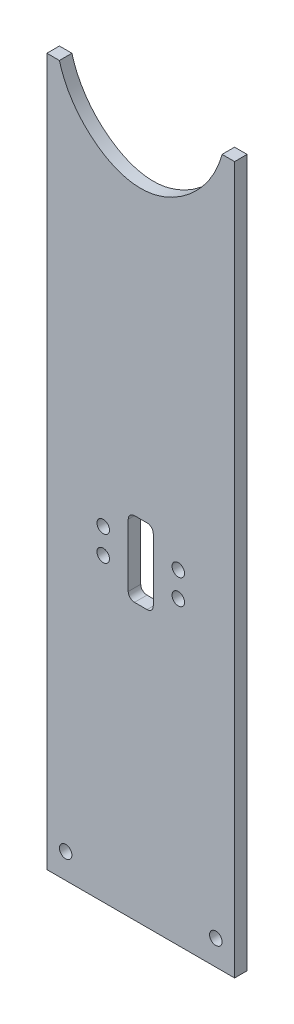
ISO-10303-21;
HEADER;
FILE_DESCRIPTION(('STEP AP214'),'2;1');
FILE_NAME('part.step','',(''),(''),'','','');
FILE_SCHEMA(('AUTOMOTIVE_DESIGN { 1 0 10303 214 1 1 1 1 }'));
ENDSEC;
DATA;
#1=APPLICATION_CONTEXT('core data for automotive mechanical design processes');
#2=APPLICATION_PROTOCOL_DEFINITION('international standard','automotive_design',2000,#1);
#3=PRODUCT_CONTEXT('',#1,'mechanical');
#4=PRODUCT('Part','Part','',(#3));
#5=PRODUCT_RELATED_PRODUCT_CATEGORY('part','',(#4));
#6=PRODUCT_DEFINITION_FORMATION('','',#4);
#7=PRODUCT_DEFINITION_CONTEXT('part definition',#1,'design');
#8=PRODUCT_DEFINITION('design','',#6,#7);
#9=PRODUCT_DEFINITION_SHAPE('','',#8);
#10=(LENGTH_UNIT() NAMED_UNIT(*) SI_UNIT(.MILLI.,.METRE.));
#11=(NAMED_UNIT(*) PLANE_ANGLE_UNIT() SI_UNIT($,.RADIAN.));
#12=(NAMED_UNIT(*) SI_UNIT($,.STERADIAN.) SOLID_ANGLE_UNIT());
#13=UNCERTAINTY_MEASURE_WITH_UNIT(LENGTH_MEASURE(1.E-05),#10,'distance_accuracy_value','');
#14=(GEOMETRIC_REPRESENTATION_CONTEXT(3) GLOBAL_UNCERTAINTY_ASSIGNED_CONTEXT((#13)) GLOBAL_UNIT_ASSIGNED_CONTEXT((#10,
#11,#12)) REPRESENTATION_CONTEXT('',''));
#15=CARTESIAN_POINT('',(0.,0.,0.));
#16=DIRECTION('',(0.,0.,1.));
#17=DIRECTION('',(1.,0.,0.));
#18=AXIS2_PLACEMENT_3D('',#15,#16,#17);
#19=CARTESIAN_POINT('',(0.,0.,6.35));
#20=DIRECTION('',(1.,0.,0.));
#21=DIRECTION('',(0.,0.,-1.));
#22=AXIS2_PLACEMENT_3D('',#19,#20,#21);
#23=PLANE('',#22);
#24=DIRECTION('',(0.,-1.,0.));
#25=VECTOR('',#24,1.);
#26=CARTESIAN_POINT('',(0.,0.,6.35));
#27=LINE('',#26,#25);
#28=CARTESIAN_POINT('',(0.,358.795396351197,6.35));
#29=VERTEX_POINT('',#28);
#30=CARTESIAN_POINT('',(0.,0.,6.35));
#31=VERTEX_POINT('',#30);
#32=EDGE_CURVE('E291',#29,#31,#27,.T.);
#33=ORIENTED_EDGE('',*,*,#32,.F.);
#34=DIRECTION('',(0.,0.,-1.));
#35=VECTOR('',#34,1.);
#36=CARTESIAN_POINT('',(0.,358.795396351197,6.35));
#37=LINE('',#36,#35);
#38=CARTESIAN_POINT('',(0.,358.795396351197,0.));
#39=VERTEX_POINT('',#38);
#40=EDGE_CURVE('E303',#29,#39,#37,.T.);
#41=ORIENTED_EDGE('',*,*,#40,.T.);
#42=DIRECTION('',(0.,-1.,0.));
#43=VECTOR('',#42,1.);
#44=CARTESIAN_POINT('',(0.,0.,0.));
#45=LINE('',#44,#43);
#46=CARTESIAN_POINT('',(0.,0.,0.));
#47=VERTEX_POINT('',#46);
#48=EDGE_CURVE('E282',#39,#47,#45,.T.);
#49=ORIENTED_EDGE('',*,*,#48,.T.);
#50=DIRECTION('',(0.,0.,-1.));
#51=VECTOR('',#50,1.);
#52=CARTESIAN_POINT('',(0.,0.,6.35));
#53=LINE('',#52,#51);
#54=EDGE_CURVE('E11',#31,#47,#53,.T.);
#55=ORIENTED_EDGE('',*,*,#54,.F.);
#56=EDGE_LOOP('',(#33,#41,#49,#55));
#57=FACE_BOUND('',#56,.T.);
#58=ADVANCED_FACE('F34',(#57),#23,.F.);
#59=CARTESIAN_POINT('',(0.,0.,6.35));
#60=DIRECTION('',(0.,1.,0.));
#61=DIRECTION('',(0.,0.,1.));
#62=AXIS2_PLACEMENT_3D('',#59,#60,#61);
#63=PLANE('',#62);
#64=DIRECTION('',(1.,0.,0.));
#65=VECTOR('',#64,1.);
#66=CARTESIAN_POINT('',(0.,0.,0.));
#67=LINE('',#66,#65);
#68=CARTESIAN_POINT('',(95.25,0.,0.));
#69=VERTEX_POINT('',#68);
#70=EDGE_CURVE('E273',#47,#69,#67,.T.);
#71=ORIENTED_EDGE('',*,*,#70,.T.);
#72=DIRECTION('',(0.,0.,-1.));
#73=VECTOR('',#72,1.);
#74=CARTESIAN_POINT('',(95.25,0.,6.35));
#75=LINE('',#74,#73);
#76=CARTESIAN_POINT('',(95.25,0.,6.35));
#77=VERTEX_POINT('',#76);
#78=EDGE_CURVE('E41',#77,#69,#75,.T.);
#79=ORIENTED_EDGE('',*,*,#78,.F.);
#80=DIRECTION('',(1.,0.,0.));
#81=VECTOR('',#80,1.);
#82=CARTESIAN_POINT('',(0.,0.,6.35));
#83=LINE('',#82,#81);
#84=EDGE_CURVE('E293',#31,#77,#83,.T.);
#85=ORIENTED_EDGE('',*,*,#84,.F.);
#86=ORIENTED_EDGE('',*,*,#54,.T.);
#87=EDGE_LOOP('',(#71,#79,#85,#86));
#88=FACE_BOUND('',#87,.T.);
#89=ADVANCED_FACE('F261',(#88),#63,.F.);
#90=CARTESIAN_POINT('',(95.25,0.,6.35));
#91=DIRECTION('',(-1.,0.,0.));
#92=DIRECTION('',(0.,0.,1.));
#93=AXIS2_PLACEMENT_3D('',#90,#91,#92);
#94=PLANE('',#93);
#95=DIRECTION('',(0.,1.,0.));
#96=VECTOR('',#95,1.);
#97=CARTESIAN_POINT('',(95.25,0.,0.));
#98=LINE('',#97,#96);
#99=CARTESIAN_POINT('',(95.25,358.795116355375,0.));
#100=VERTEX_POINT('',#99);
#101=EDGE_CURVE('E281',#69,#100,#98,.T.);
#102=ORIENTED_EDGE('',*,*,#101,.T.);
#103=DIRECTION('',(0.,0.,-1.));
#104=VECTOR('',#103,1.);
#105=CARTESIAN_POINT('',(95.25,358.795116355375,6.35));
#106=LINE('',#105,#104);
#107=CARTESIAN_POINT('',(95.25,358.795116355375,6.35));
#108=VERTEX_POINT('',#107);
#109=EDGE_CURVE('E307',#108,#100,#106,.T.);
#110=ORIENTED_EDGE('',*,*,#109,.F.);
#111=DIRECTION('',(0.,1.,0.));
#112=VECTOR('',#111,1.);
#113=CARTESIAN_POINT('',(95.25,0.,6.35));
#114=LINE('',#113,#112);
#115=EDGE_CURVE('E287',#77,#108,#114,.T.);
#116=ORIENTED_EDGE('',*,*,#115,.F.);
#117=ORIENTED_EDGE('',*,*,#78,.T.);
#118=EDGE_LOOP('',(#102,#110,#116,#117));
#119=FACE_BOUND('',#118,.T.);
#120=ADVANCED_FACE('F255',(#119),#94,.F.);
#121=CARTESIAN_POINT('',(0.,0.,6.35));
#122=DIRECTION('',(0.,0.,-1.));
#123=DIRECTION('',(-1.,0.,0.));
#124=AXIS2_PLACEMENT_3D('',#121,#122,#123);
#125=PLANE('',#124);
#126=CARTESIAN_POINT('',(85.725,12.7,6.35));
#127=DIRECTION('',(0.,0.,-1.));
#128=DIRECTION('',(-1.,0.,0.));
#129=AXIS2_PLACEMENT_3D('',#126,#127,#128);
#130=CIRCLE('',#129,3.175);
#131=CARTESIAN_POINT('',(82.55,12.7,6.35));
#132=VERTEX_POINT('',#131);
#133=EDGE_CURVE('E387',#132,#132,#130,.T.);
#134=ORIENTED_EDGE('',*,*,#133,.T.);
#135=EDGE_LOOP('',(#134));
#136=FACE_BOUND('',#135,.T.);
#137=CARTESIAN_POINT('',(9.525,12.7,6.35));
#138=DIRECTION('',(0.,0.,-1.));
#139=DIRECTION('',(-1.,0.,0.));
#140=AXIS2_PLACEMENT_3D('',#137,#138,#139);
#141=CIRCLE('',#140,3.175);
#142=CARTESIAN_POINT('',(6.35,12.7,6.35));
#143=VERTEX_POINT('',#142);
#144=EDGE_CURVE('E177',#143,#143,#141,.T.);
#145=ORIENTED_EDGE('',*,*,#144,.T.);
#146=EDGE_LOOP('',(#145));
#147=FACE_BOUND('',#146,.T.);
#148=DIRECTION('',(0.,-1.,0.));
#149=VECTOR('',#148,1.);
#150=CARTESIAN_POINT('',(53.975,174.625,6.35));
#151=LINE('',#150,#149);
#152=CARTESIAN_POINT('',(53.975,174.625,6.35));
#153=VERTEX_POINT('',#152);
#154=CARTESIAN_POINT('',(53.975,142.875,6.35));
#155=VERTEX_POINT('',#154);
#156=EDGE_CURVE('E142',#153,#155,#151,.T.);
#157=ORIENTED_EDGE('',*,*,#156,.T.);
#158=CARTESIAN_POINT('',(50.8,142.875,6.35));
#159=DIRECTION('',(0.,0.,-1.));
#160=DIRECTION('',(-1.,0.,0.));
#161=AXIS2_PLACEMENT_3D('',#158,#159,#160);
#162=CIRCLE('',#161,3.175);
#163=CARTESIAN_POINT('',(50.8,139.7,6.35));
#164=VERTEX_POINT('',#163);
#165=EDGE_CURVE('E136',#155,#164,#162,.T.);
#166=ORIENTED_EDGE('',*,*,#165,.T.);
#167=DIRECTION('',(-1.,0.,0.));
#168=VECTOR('',#167,1.);
#169=CARTESIAN_POINT('',(50.8,139.7,6.35));
#170=LINE('',#169,#168);
#171=CARTESIAN_POINT('',(44.45,139.7,6.35));
#172=VERTEX_POINT('',#171);
#173=EDGE_CURVE('E145',#164,#172,#170,.T.);
#174=ORIENTED_EDGE('',*,*,#173,.T.);
#175=CARTESIAN_POINT('',(44.45,142.875,6.35));
#176=DIRECTION('',(0.,0.,-1.));
#177=DIRECTION('',(-1.,0.,0.));
#178=AXIS2_PLACEMENT_3D('',#175,#176,#177);
#179=CIRCLE('',#178,3.175);
#180=CARTESIAN_POINT('',(41.275,142.875,6.35));
#181=VERTEX_POINT('',#180);
#182=EDGE_CURVE('E48',#172,#181,#179,.T.);
#183=ORIENTED_EDGE('',*,*,#182,.T.);
#184=DIRECTION('',(0.,1.,0.));
#185=VECTOR('',#184,1.);
#186=CARTESIAN_POINT('',(41.275,174.625,6.35));
#187=LINE('',#186,#185);
#188=CARTESIAN_POINT('',(41.275,174.625,6.35));
#189=VERTEX_POINT('',#188);
#190=EDGE_CURVE('E163',#181,#189,#187,.T.);
#191=ORIENTED_EDGE('',*,*,#190,.T.);
#192=CARTESIAN_POINT('',(44.45,174.625,6.35));
#193=DIRECTION('',(0.,0.,-1.));
#194=DIRECTION('',(1.,0.,0.));
#195=AXIS2_PLACEMENT_3D('',#192,#193,#194);
#196=CIRCLE('',#195,3.175);
#197=CARTESIAN_POINT('',(44.45,177.8,6.35));
#198=VERTEX_POINT('',#197);
#199=EDGE_CURVE('E166',#189,#198,#196,.T.);
#200=ORIENTED_EDGE('',*,*,#199,.T.);
#201=DIRECTION('',(1.,0.,0.));
#202=VECTOR('',#201,1.);
#203=CARTESIAN_POINT('',(50.8,177.8,6.35));
#204=LINE('',#203,#202);
#205=CARTESIAN_POINT('',(50.8,177.8,6.35));
#206=VERTEX_POINT('',#205);
#207=EDGE_CURVE('E169',#198,#206,#204,.T.);
#208=ORIENTED_EDGE('',*,*,#207,.T.);
#209=CARTESIAN_POINT('',(50.8,174.625,6.35));
#210=DIRECTION('',(0.,0.,-1.));
#211=DIRECTION('',(-1.,0.,0.));
#212=AXIS2_PLACEMENT_3D('',#209,#210,#211);
#213=CIRCLE('',#212,3.175);
#214=EDGE_CURVE('E172',#206,#153,#213,.T.);
#215=ORIENTED_EDGE('',*,*,#214,.T.);
#216=EDGE_LOOP('',(#157,#166,#174,#183,#191,#200,#208,#215));
#217=FACE_BOUND('',#216,.T.);
#218=CARTESIAN_POINT('',(28.575,152.4,6.35));
#219=DIRECTION('',(0.,0.,-1.));
#220=DIRECTION('',(1.,0.,0.));
#221=AXIS2_PLACEMENT_3D('',#218,#219,#220);
#222=CIRCLE('',#221,3.17499999999999);
#223=CARTESIAN_POINT('',(31.75,152.4,6.35));
#224=VERTEX_POINT('',#223);
#225=EDGE_CURVE('E207',#224,#224,#222,.T.);
#226=ORIENTED_EDGE('',*,*,#225,.T.);
#227=EDGE_LOOP('',(#226));
#228=FACE_BOUND('',#227,.T.);
#229=CARTESIAN_POINT('',(66.675,152.4,6.35));
#230=DIRECTION('',(0.,0.,-1.));
#231=DIRECTION('',(1.,0.,0.));
#232=AXIS2_PLACEMENT_3D('',#229,#230,#231);
#233=CIRCLE('',#232,3.17499999999999);
#234=CARTESIAN_POINT('',(69.85,152.4,6.35));
#235=VERTEX_POINT('',#234);
#236=EDGE_CURVE('E213',#235,#235,#233,.T.);
#237=ORIENTED_EDGE('',*,*,#236,.T.);
#238=EDGE_LOOP('',(#237));
#239=FACE_BOUND('',#238,.T.);
#240=CARTESIAN_POINT('',(66.675,165.1,6.35));
#241=DIRECTION('',(0.,0.,-1.));
#242=DIRECTION('',(-1.,0.,0.));
#243=AXIS2_PLACEMENT_3D('',#240,#241,#242);
#244=CIRCLE('',#243,3.175);
#245=CARTESIAN_POINT('',(63.5,165.1,6.35));
#246=VERTEX_POINT('',#245);
#247=EDGE_CURVE('E219',#246,#246,#244,.T.);
#248=ORIENTED_EDGE('',*,*,#247,.T.);
#249=EDGE_LOOP('',(#248));
#250=FACE_BOUND('',#249,.T.);
#251=CARTESIAN_POINT('',(28.575,165.1,6.35));
#252=DIRECTION('',(0.,0.,-1.));
#253=DIRECTION('',(-1.,0.,0.));
#254=AXIS2_PLACEMENT_3D('',#251,#252,#253);
#255=CIRCLE('',#254,3.175);
#256=CARTESIAN_POINT('',(25.4,165.1,6.35));
#257=VERTEX_POINT('',#256);
#258=EDGE_CURVE('E225',#257,#257,#255,.T.);
#259=ORIENTED_EDGE('',*,*,#258,.T.);
#260=EDGE_LOOP('',(#259));
#261=FACE_BOUND('',#260,.T.);
#262=ORIENTED_EDGE('',*,*,#115,.T.);
#263=DIRECTION('',(-1.,0.,0.));
#264=VECTOR('',#263,1.);
#265=CARTESIAN_POINT('',(95.25,358.795116355375,6.35));
#266=LINE('',#265,#264);
#267=CARTESIAN_POINT('',(88.899916477598,358.795116355375,6.35));
#268=VERTEX_POINT('',#267);
#269=EDGE_CURVE('E304',#108,#268,#266,.T.);
#270=ORIENTED_EDGE('',*,*,#269,.T.);
#271=CARTESIAN_POINT('',(88.899916477598,358.795116355375,6.35));
#272=CARTESIAN_POINT('',(88.7469189568532,358.220859299187,6.35));
#273=CARTESIAN_POINT('',(87.9813880159432,355.548098122294,6.35));
#274=CARTESIAN_POINT('',(86.1567324789727,350.776147046401,6.35));
#275=CARTESIAN_POINT('',(82.7934471855316,344.659309890991,6.35));
#276=CARTESIAN_POINT('',(78.5536636980086,339.000351460311,6.35));
#277=CARTESIAN_POINT('',(73.5683289838398,333.940394202016,6.35));
#278=CARTESIAN_POINT('',(67.9027653148395,329.602048826114,6.35));
#279=CARTESIAN_POINT('',(61.7599476653267,326.175234428604,6.35));
#280=CARTESIAN_POINT('',(56.011278232285,324.163968737042,6.35));
#281=CARTESIAN_POINT('',(51.2741611288846,323.32701256657,6.35));
#282=CARTESIAN_POINT('',(47.6263931999982,323.106329306253,6.35));
#283=CARTESIAN_POINT('',(43.9647796760453,323.327682291623,6.35));
#284=CARTESIAN_POINT('',(39.2301330380058,324.16791478845,6.35));
#285=CARTESIAN_POINT('',(33.4930306256659,326.166537811565,6.35));
#286=CARTESIAN_POINT('',(27.1992758422986,329.696450217225,6.35));
#287=CARTESIAN_POINT('',(19.7537431350209,335.438425445548,6.35));
#288=CARTESIAN_POINT('',(13.5095360809173,342.720425858591,6.35));
#289=CARTESIAN_POINT('',(9.09151745573243,350.781784076635,6.35));
#290=CARTESIAN_POINT('',(7.36140009700378,355.320896006168,6.35));
#291=CARTESIAN_POINT('',(6.58280825573466,357.943053332327,6.35));
#292=CARTESIAN_POINT('',(6.42575524570973,358.510985770703,6.35));
#293=CARTESIAN_POINT('',(6.3499612256765,358.795396351198,6.35));
#294=B_SPLINE_CURVE_WITH_KNOTS('',3,(#271,#272,#273,#274,#275,#276,#277,#278,#279,#280,#281,
#282,#283,#284,#285,#286,#287,#288,#289,#290,#291,#292,#293),.UNSPECIFIED.,.F.,.F.,(4,1,1,1,1,1,
1,1,1,1,1,1,1,1,1,1,1,1,1,1,4),(0.244653944275553,0.252466444275598,0.28125,0.3125,0.34375,
0.375,0.40625,0.4375,0.46875,0.484375,0.5,0.515625,0.53125,0.5625,0.59375,0.625,0.6875,0.71875,
0.747082052264084,0.750988302264084,0.754894552264131),.UNSPECIFIED.);
#295=CARTESIAN_POINT('',(6.3499612256765,358.795396351198,6.35));
#296=VERTEX_POINT('',#295);
#297=EDGE_CURVE('E231',#268,#296,#294,.T.);
#298=ORIENTED_EDGE('',*,*,#297,.T.);
#299=DIRECTION('',(-1.,0.,0.));
#300=VECTOR('',#299,1.);
#301=CARTESIAN_POINT('',(0.,358.795396351197,6.35));
#302=LINE('',#301,#300);
#303=EDGE_CURVE('E237',#296,#29,#302,.T.);
#304=ORIENTED_EDGE('',*,*,#303,.T.);
#305=ORIENTED_EDGE('',*,*,#32,.T.);
#306=ORIENTED_EDGE('',*,*,#84,.T.);
#307=EDGE_LOOP('',(#262,#270,#298,#304,#305,#306));
#308=FACE_BOUND('',#307,.T.);
#309=ADVANCED_FACE('F149',(#136,#147,#217,#228,#239,#250,#261,#308),#125,.F.);
#310=CARTESIAN_POINT('',(0.,0.,0.));
#311=DIRECTION('',(0.,0.,-1.));
#312=DIRECTION('',(-1.,0.,0.));
#313=AXIS2_PLACEMENT_3D('',#310,#311,#312);
#314=PLANE('',#313);
#315=CARTESIAN_POINT('',(85.725,12.7,0.));
#316=DIRECTION('',(0.,0.,-1.));
#317=DIRECTION('',(-1.,0.,0.));
#318=AXIS2_PLACEMENT_3D('',#315,#316,#317);
#319=CIRCLE('',#318,3.175);
#320=CARTESIAN_POINT('',(82.55,12.7,0.));
#321=VERTEX_POINT('',#320);
#322=EDGE_CURVE('E390',#321,#321,#319,.T.);
#323=ORIENTED_EDGE('',*,*,#322,.F.);
#324=EDGE_LOOP('',(#323));
#325=FACE_BOUND('',#324,.T.);
#326=CARTESIAN_POINT('',(9.525,12.7,0.));
#327=DIRECTION('',(0.,0.,-1.));
#328=DIRECTION('',(-1.,0.,0.));
#329=AXIS2_PLACEMENT_3D('',#326,#327,#328);
#330=CIRCLE('',#329,3.175);
#331=CARTESIAN_POINT('',(6.35,12.7,0.));
#332=VERTEX_POINT('',#331);
#333=EDGE_CURVE('E159',#332,#332,#330,.T.);
#334=ORIENTED_EDGE('',*,*,#333,.F.);
#335=EDGE_LOOP('',(#334));
#336=FACE_BOUND('',#335,.T.);
#337=CARTESIAN_POINT('',(50.8,142.875,0.));
#338=DIRECTION('',(0.,0.,-1.));
#339=DIRECTION('',(-1.,0.,0.));
#340=AXIS2_PLACEMENT_3D('',#337,#338,#339);
#341=CIRCLE('',#340,3.175);
#342=CARTESIAN_POINT('',(53.975,142.875,0.));
#343=VERTEX_POINT('',#342);
#344=CARTESIAN_POINT('',(50.8,139.7,0.));
#345=VERTEX_POINT('',#344);
#346=EDGE_CURVE('E56',#343,#345,#341,.T.);
#347=ORIENTED_EDGE('',*,*,#346,.F.);
#348=DIRECTION('',(0.,-1.,0.));
#349=VECTOR('',#348,1.);
#350=CARTESIAN_POINT('',(53.975,174.625,0.));
#351=LINE('',#350,#349);
#352=CARTESIAN_POINT('',(53.975,174.625,0.));
#353=VERTEX_POINT('',#352);
#354=EDGE_CURVE('E153',#353,#343,#351,.T.);
#355=ORIENTED_EDGE('',*,*,#354,.F.);
#356=CARTESIAN_POINT('',(50.8,174.625,0.));
#357=DIRECTION('',(0.,0.,-1.));
#358=DIRECTION('',(-1.,0.,0.));
#359=AXIS2_PLACEMENT_3D('',#356,#357,#358);
#360=CIRCLE('',#359,3.175);
#361=CARTESIAN_POINT('',(50.8,177.8,0.));
#362=VERTEX_POINT('',#361);
#363=EDGE_CURVE('E156',#362,#353,#360,.T.);
#364=ORIENTED_EDGE('',*,*,#363,.F.);
#365=DIRECTION('',(1.,0.,0.));
#366=VECTOR('',#365,1.);
#367=CARTESIAN_POINT('',(50.8,177.8,0.));
#368=LINE('',#367,#366);
#369=CARTESIAN_POINT('',(44.45,177.8,0.));
#370=VERTEX_POINT('',#369);
#371=EDGE_CURVE('E188',#370,#362,#368,.T.);
#372=ORIENTED_EDGE('',*,*,#371,.F.);
#373=CARTESIAN_POINT('',(44.45,174.625,0.));
#374=DIRECTION('',(0.,0.,-1.));
#375=DIRECTION('',(1.,0.,0.));
#376=AXIS2_PLACEMENT_3D('',#373,#374,#375);
#377=CIRCLE('',#376,3.175);
#378=CARTESIAN_POINT('',(41.275,174.625,0.));
#379=VERTEX_POINT('',#378);
#380=EDGE_CURVE('E185',#379,#370,#377,.T.);
#381=ORIENTED_EDGE('',*,*,#380,.F.);
#382=DIRECTION('',(0.,1.,0.));
#383=VECTOR('',#382,1.);
#384=CARTESIAN_POINT('',(41.275,174.625,0.));
#385=LINE('',#384,#383);
#386=CARTESIAN_POINT('',(41.275,142.875,0.));
#387=VERTEX_POINT('',#386);
#388=EDGE_CURVE('E182',#387,#379,#385,.T.);
#389=ORIENTED_EDGE('',*,*,#388,.F.);
#390=CARTESIAN_POINT('',(44.45,142.875,0.));
#391=DIRECTION('',(0.,0.,-1.));
#392=DIRECTION('',(-1.,0.,0.));
#393=AXIS2_PLACEMENT_3D('',#390,#391,#392);
#394=CIRCLE('',#393,3.175);
#395=CARTESIAN_POINT('',(44.45,139.7,0.));
#396=VERTEX_POINT('',#395);
#397=EDGE_CURVE('E179',#396,#387,#394,.T.);
#398=ORIENTED_EDGE('',*,*,#397,.F.);
#399=DIRECTION('',(-1.,0.,0.));
#400=VECTOR('',#399,1.);
#401=CARTESIAN_POINT('',(50.8,139.7,0.));
#402=LINE('',#401,#400);
#403=EDGE_CURVE('E176',#345,#396,#402,.T.);
#404=ORIENTED_EDGE('',*,*,#403,.F.);
#405=EDGE_LOOP('',(#347,#355,#364,#372,#381,#389,#398,#404));
#406=FACE_BOUND('',#405,.T.);
#407=CARTESIAN_POINT('',(28.575,152.4,0.));
#408=DIRECTION('',(0.,0.,-1.));
#409=DIRECTION('',(1.,0.,0.));
#410=AXIS2_PLACEMENT_3D('',#407,#408,#409);
#411=CIRCLE('',#410,3.17499999999999);
#412=CARTESIAN_POINT('',(31.75,152.4,0.));
#413=VERTEX_POINT('',#412);
#414=EDGE_CURVE('E195',#413,#413,#411,.T.);
#415=ORIENTED_EDGE('',*,*,#414,.F.);
#416=EDGE_LOOP('',(#415));
#417=FACE_BOUND('',#416,.T.);
#418=CARTESIAN_POINT('',(66.675,152.4,0.));
#419=DIRECTION('',(0.,0.,-1.));
#420=DIRECTION('',(1.,0.,0.));
#421=AXIS2_PLACEMENT_3D('',#418,#419,#420);
#422=CIRCLE('',#421,3.17499999999999);
#423=CARTESIAN_POINT('',(69.85,152.4,0.));
#424=VERTEX_POINT('',#423);
#425=EDGE_CURVE('E210',#424,#424,#422,.T.);
#426=ORIENTED_EDGE('',*,*,#425,.F.);
#427=EDGE_LOOP('',(#426));
#428=FACE_BOUND('',#427,.T.);
#429=CARTESIAN_POINT('',(66.675,165.1,0.));
#430=DIRECTION('',(0.,0.,-1.));
#431=DIRECTION('',(-1.,0.,0.));
#432=AXIS2_PLACEMENT_3D('',#429,#430,#431);
#433=CIRCLE('',#432,3.175);
#434=CARTESIAN_POINT('',(63.5,165.1,0.));
#435=VERTEX_POINT('',#434);
#436=EDGE_CURVE('E216',#435,#435,#433,.T.);
#437=ORIENTED_EDGE('',*,*,#436,.F.);
#438=EDGE_LOOP('',(#437));
#439=FACE_BOUND('',#438,.T.);
#440=CARTESIAN_POINT('',(28.575,165.1,0.));
#441=DIRECTION('',(0.,0.,-1.));
#442=DIRECTION('',(-1.,0.,0.));
#443=AXIS2_PLACEMENT_3D('',#440,#441,#442);
#444=CIRCLE('',#443,3.175);
#445=CARTESIAN_POINT('',(25.4,165.1,0.));
#446=VERTEX_POINT('',#445);
#447=EDGE_CURVE('E222',#446,#446,#444,.T.);
#448=ORIENTED_EDGE('',*,*,#447,.F.);
#449=EDGE_LOOP('',(#448));
#450=FACE_BOUND('',#449,.T.);
#451=DIRECTION('',(-1.,0.,0.));
#452=VECTOR('',#451,1.);
#453=CARTESIAN_POINT('',(95.25,358.795116355375,0.));
#454=LINE('',#453,#452);
#455=CARTESIAN_POINT('',(88.899916477598,358.795116355375,0.));
#456=VERTEX_POINT('',#455);
#457=EDGE_CURVE('E238',#100,#456,#454,.T.);
#458=ORIENTED_EDGE('',*,*,#457,.F.);
#459=ORIENTED_EDGE('',*,*,#101,.F.);
#460=ORIENTED_EDGE('',*,*,#70,.F.);
#461=ORIENTED_EDGE('',*,*,#48,.F.);
#462=DIRECTION('',(-1.,0.,0.));
#463=VECTOR('',#462,1.);
#464=CARTESIAN_POINT('',(0.,358.795396351197,0.));
#465=LINE('',#464,#463);
#466=CARTESIAN_POINT('',(6.3499612256765,358.795396351198,0.));
#467=VERTEX_POINT('',#466);
#468=EDGE_CURVE('E311',#467,#39,#465,.T.);
#469=ORIENTED_EDGE('',*,*,#468,.F.);
#470=CARTESIAN_POINT('',(88.899916477598,358.795116355375,0.));
#471=CARTESIAN_POINT('',(88.7469189568532,358.220859299187,0.));
#472=CARTESIAN_POINT('',(87.9813880159432,355.548098122294,0.));
#473=CARTESIAN_POINT('',(86.1567324789727,350.776147046401,0.));
#474=CARTESIAN_POINT('',(82.7934471855316,344.659309890991,0.));
#475=CARTESIAN_POINT('',(78.5536636980086,339.000351460311,0.));
#476=CARTESIAN_POINT('',(73.5683289838398,333.940394202016,0.));
#477=CARTESIAN_POINT('',(67.9027653148395,329.602048826114,0.));
#478=CARTESIAN_POINT('',(61.7599476653267,326.175234428604,0.));
#479=CARTESIAN_POINT('',(56.011278232285,324.163968737042,0.));
#480=CARTESIAN_POINT('',(51.2741611288846,323.32701256657,0.));
#481=CARTESIAN_POINT('',(47.6263931999982,323.106329306253,0.));
#482=CARTESIAN_POINT('',(43.9647796760453,323.327682291623,0.));
#483=CARTESIAN_POINT('',(39.2301330380058,324.16791478845,0.));
#484=CARTESIAN_POINT('',(33.4930306256659,326.166537811565,0.));
#485=CARTESIAN_POINT('',(27.1992758422986,329.696450217225,0.));
#486=CARTESIAN_POINT('',(19.7537431350209,335.438425445548,0.));
#487=CARTESIAN_POINT('',(13.5095360809173,342.720425858591,0.));
#488=CARTESIAN_POINT('',(9.09151745573243,350.781784076635,0.));
#489=CARTESIAN_POINT('',(7.36140009700378,355.320896006168,0.));
#490=CARTESIAN_POINT('',(6.58280825573466,357.943053332327,0.));
#491=CARTESIAN_POINT('',(6.42575524570973,358.510985770703,0.));
#492=CARTESIAN_POINT('',(6.3499612256765,358.795396351198,0.));
#493=B_SPLINE_CURVE_WITH_KNOTS('',3,(#470,#471,#472,#473,#474,#475,#476,#477,#478,#479,#480,
#481,#482,#483,#484,#485,#486,#487,#488,#489,#490,#491,#492),.UNSPECIFIED.,.F.,.F.,(4,1,1,1,1,1,
1,1,1,1,1,1,1,1,1,1,1,1,1,1,4),(0.244653944275553,0.252466444275598,0.28125,0.3125,0.34375,
0.375,0.40625,0.4375,0.46875,0.484375,0.5,0.515625,0.53125,0.5625,0.59375,0.625,0.6875,0.71875,
0.747082052264084,0.750988302264084,0.754894552264131),.UNSPECIFIED.);
#494=EDGE_CURVE('E228',#456,#467,#493,.T.);
#495=ORIENTED_EDGE('',*,*,#494,.F.);
#496=EDGE_LOOP('',(#458,#459,#460,#461,#469,#495));
#497=FACE_BOUND('',#496,.T.);
#498=ADVANCED_FACE('F249',(#325,#336,#406,#417,#428,#439,#450,#497),#314,.T.);
#499=DIRECTION('',(0.,0.,-1.));
#500=VECTOR('',#499,1.);
#501=SURFACE_OF_LINEAR_EXTRUSION('',#294,#500);
#502=ORIENTED_EDGE('',*,*,#494,.T.);
#503=DIRECTION('',(0.,0.,-1.));
#504=VECTOR('',#503,1.);
#505=CARTESIAN_POINT('',(6.3499612256765,358.795396351198,6.35));
#506=LINE('',#505,#504);
#507=EDGE_CURVE('E300',#296,#467,#506,.T.);
#508=ORIENTED_EDGE('',*,*,#507,.F.);
#509=ORIENTED_EDGE('',*,*,#297,.F.);
#510=DIRECTION('',(0.,0.,-1.));
#511=VECTOR('',#510,1.);
#512=CARTESIAN_POINT('',(88.899916477598,358.795116355375,6.35));
#513=LINE('',#512,#511);
#514=EDGE_CURVE('E297',#268,#456,#513,.T.);
#515=ORIENTED_EDGE('',*,*,#514,.T.);
#516=EDGE_LOOP('',(#502,#508,#509,#515));
#517=FACE_BOUND('',#516,.T.);
#518=ADVANCED_FACE('F244',(#517),#501,.F.);
#519=CARTESIAN_POINT('',(95.25,358.795116355375,6.35));
#520=DIRECTION('',(0.,-1.,0.));
#521=DIRECTION('',(0.,0.,-1.));
#522=AXIS2_PLACEMENT_3D('',#519,#520,#521);
#523=PLANE('',#522);
#524=ORIENTED_EDGE('',*,*,#457,.T.);
#525=ORIENTED_EDGE('',*,*,#514,.F.);
#526=ORIENTED_EDGE('',*,*,#269,.F.);
#527=ORIENTED_EDGE('',*,*,#109,.T.);
#528=EDGE_LOOP('',(#524,#525,#526,#527));
#529=FACE_BOUND('',#528,.T.);
#530=ADVANCED_FACE('F248',(#529),#523,.F.);
#531=CARTESIAN_POINT('',(0.,358.795396351197,6.35));
#532=DIRECTION('',(0.,-1.,0.));
#533=DIRECTION('',(1.,0.,0.));
#534=AXIS2_PLACEMENT_3D('',#531,#532,#533);
#535=PLANE('',#534);
#536=ORIENTED_EDGE('',*,*,#468,.T.);
#537=ORIENTED_EDGE('',*,*,#40,.F.);
#538=ORIENTED_EDGE('',*,*,#303,.F.);
#539=ORIENTED_EDGE('',*,*,#507,.T.);
#540=EDGE_LOOP('',(#536,#537,#538,#539));
#541=FACE_BOUND('',#540,.T.);
#542=ADVANCED_FACE('F251',(#541),#535,.F.);
#543=CARTESIAN_POINT('',(28.575,165.1,6.35));
#544=DIRECTION('',(0.,0.,-1.));
#545=DIRECTION('',(-1.,0.,0.));
#546=AXIS2_PLACEMENT_3D('',#543,#544,#545);
#547=CYLINDRICAL_SURFACE('',#546,3.175);
#548=ORIENTED_EDGE('',*,*,#258,.F.);
#549=EDGE_LOOP('',(#548));
#550=FACE_BOUND('',#549,.T.);
#551=ORIENTED_EDGE('',*,*,#447,.T.);
#552=EDGE_LOOP('',(#551));
#553=FACE_BOUND('',#552,.T.);
#554=ADVANCED_FACE('F331',(#550,#553),#547,.F.);
#555=CARTESIAN_POINT('',(66.675,165.1,6.35));
#556=DIRECTION('',(0.,0.,-1.));
#557=DIRECTION('',(-1.,0.,0.));
#558=AXIS2_PLACEMENT_3D('',#555,#556,#557);
#559=CYLINDRICAL_SURFACE('',#558,3.175);
#560=ORIENTED_EDGE('',*,*,#247,.F.);
#561=EDGE_LOOP('',(#560));
#562=FACE_BOUND('',#561,.T.);
#563=ORIENTED_EDGE('',*,*,#436,.T.);
#564=EDGE_LOOP('',(#563));
#565=FACE_BOUND('',#564,.T.);
#566=ADVANCED_FACE('F335',(#562,#565),#559,.F.);
#567=CARTESIAN_POINT('',(66.675,152.4,6.35));
#568=DIRECTION('',(0.,0.,-1.));
#569=DIRECTION('',(-1.,0.,0.));
#570=AXIS2_PLACEMENT_3D('',#567,#568,#569);
#571=CYLINDRICAL_SURFACE('',#570,3.17499999999999);
#572=ORIENTED_EDGE('',*,*,#236,.F.);
#573=EDGE_LOOP('',(#572));
#574=FACE_BOUND('',#573,.T.);
#575=ORIENTED_EDGE('',*,*,#425,.T.);
#576=EDGE_LOOP('',(#575));
#577=FACE_BOUND('',#576,.T.);
#578=ADVANCED_FACE('F339',(#574,#577),#571,.F.);
#579=CARTESIAN_POINT('',(28.575,152.4,6.35));
#580=DIRECTION('',(0.,0.,-1.));
#581=DIRECTION('',(-1.,0.,0.));
#582=AXIS2_PLACEMENT_3D('',#579,#580,#581);
#583=CYLINDRICAL_SURFACE('',#582,3.17499999999999);
#584=ORIENTED_EDGE('',*,*,#225,.F.);
#585=EDGE_LOOP('',(#584));
#586=FACE_BOUND('',#585,.T.);
#587=ORIENTED_EDGE('',*,*,#414,.T.);
#588=EDGE_LOOP('',(#587));
#589=FACE_BOUND('',#588,.T.);
#590=ADVANCED_FACE('F343',(#586,#589),#583,.F.);
#591=CARTESIAN_POINT('',(50.8,142.875,6.35));
#592=DIRECTION('',(0.,0.,-1.));
#593=DIRECTION('',(-1.,0.,0.));
#594=AXIS2_PLACEMENT_3D('',#591,#592,#593);
#595=CYLINDRICAL_SURFACE('',#594,3.175);
#596=ORIENTED_EDGE('',*,*,#346,.T.);
#597=DIRECTION('',(0.,0.,-1.));
#598=VECTOR('',#597,1.);
#599=CARTESIAN_POINT('',(50.8,139.7,6.35));
#600=LINE('',#599,#598);
#601=EDGE_CURVE('E132',#164,#345,#600,.T.);
#602=ORIENTED_EDGE('',*,*,#601,.F.);
#603=ORIENTED_EDGE('',*,*,#165,.F.);
#604=DIRECTION('',(0.,0.,-1.));
#605=VECTOR('',#604,1.);
#606=CARTESIAN_POINT('',(53.975,142.875,6.35));
#607=LINE('',#606,#605);
#608=EDGE_CURVE('E193',#155,#343,#607,.T.);
#609=ORIENTED_EDGE('',*,*,#608,.T.);
#610=EDGE_LOOP('',(#596,#602,#603,#609));
#611=FACE_BOUND('',#610,.T.);
#612=ADVANCED_FACE('F134',(#611),#595,.F.);
#613=CARTESIAN_POINT('',(53.975,174.625,6.35));
#614=DIRECTION('',(1.,0.,0.));
#615=DIRECTION('',(0.,1.,0.));
#616=AXIS2_PLACEMENT_3D('',#613,#614,#615);
#617=PLANE('',#616);
#618=ORIENTED_EDGE('',*,*,#354,.T.);
#619=ORIENTED_EDGE('',*,*,#608,.F.);
#620=ORIENTED_EDGE('',*,*,#156,.F.);
#621=DIRECTION('',(0.,0.,-1.));
#622=VECTOR('',#621,1.);
#623=CARTESIAN_POINT('',(53.975,174.625,6.35));
#624=LINE('',#623,#622);
#625=EDGE_CURVE('E196',#153,#353,#624,.T.);
#626=ORIENTED_EDGE('',*,*,#625,.T.);
#627=EDGE_LOOP('',(#618,#619,#620,#626));
#628=FACE_BOUND('',#627,.T.);
#629=ADVANCED_FACE('F350',(#628),#617,.F.);
#630=CARTESIAN_POINT('',(50.8,174.625,6.35));
#631=DIRECTION('',(0.,0.,-1.));
#632=DIRECTION('',(-1.,0.,0.));
#633=AXIS2_PLACEMENT_3D('',#630,#631,#632);
#634=CYLINDRICAL_SURFACE('',#633,3.175);
#635=ORIENTED_EDGE('',*,*,#363,.T.);
#636=ORIENTED_EDGE('',*,*,#625,.F.);
#637=ORIENTED_EDGE('',*,*,#214,.F.);
#638=DIRECTION('',(0.,0.,-1.));
#639=VECTOR('',#638,1.);
#640=CARTESIAN_POINT('',(50.8,177.8,6.35));
#641=LINE('',#640,#639);
#642=EDGE_CURVE('E198',#206,#362,#641,.T.);
#643=ORIENTED_EDGE('',*,*,#642,.T.);
#644=EDGE_LOOP('',(#635,#636,#637,#643));
#645=FACE_BOUND('',#644,.T.);
#646=ADVANCED_FACE('F368',(#645),#634,.F.);
#647=CARTESIAN_POINT('',(50.8,177.8,6.35));
#648=DIRECTION('',(0.,1.,0.));
#649=DIRECTION('',(0.,0.,1.));
#650=AXIS2_PLACEMENT_3D('',#647,#648,#649);
#651=PLANE('',#650);
#652=ORIENTED_EDGE('',*,*,#371,.T.);
#653=ORIENTED_EDGE('',*,*,#642,.F.);
#654=ORIENTED_EDGE('',*,*,#207,.F.);
#655=DIRECTION('',(0.,0.,-1.));
#656=VECTOR('',#655,1.);
#657=CARTESIAN_POINT('',(44.45,177.8,6.35));
#658=LINE('',#657,#656);
#659=EDGE_CURVE('E200',#198,#370,#658,.T.);
#660=ORIENTED_EDGE('',*,*,#659,.T.);
#661=EDGE_LOOP('',(#652,#653,#654,#660));
#662=FACE_BOUND('',#661,.T.);
#663=ADVANCED_FACE('F364',(#662),#651,.F.);
#664=CARTESIAN_POINT('',(44.45,174.625,6.35));
#665=DIRECTION('',(0.,0.,-1.));
#666=DIRECTION('',(-1.,0.,0.));
#667=AXIS2_PLACEMENT_3D('',#664,#665,#666);
#668=CYLINDRICAL_SURFACE('',#667,3.175);
#669=ORIENTED_EDGE('',*,*,#380,.T.);
#670=ORIENTED_EDGE('',*,*,#659,.F.);
#671=ORIENTED_EDGE('',*,*,#199,.F.);
#672=DIRECTION('',(0.,0.,-1.));
#673=VECTOR('',#672,1.);
#674=CARTESIAN_POINT('',(41.275,174.625,6.35));
#675=LINE('',#674,#673);
#676=EDGE_CURVE('E202',#189,#379,#675,.T.);
#677=ORIENTED_EDGE('',*,*,#676,.T.);
#678=EDGE_LOOP('',(#669,#670,#671,#677));
#679=FACE_BOUND('',#678,.T.);
#680=ADVANCED_FACE('F360',(#679),#668,.F.);
#681=CARTESIAN_POINT('',(41.275,174.625,6.35));
#682=DIRECTION('',(-1.,0.,0.));
#683=DIRECTION('',(0.,-1.,0.));
#684=AXIS2_PLACEMENT_3D('',#681,#682,#683);
#685=PLANE('',#684);
#686=ORIENTED_EDGE('',*,*,#388,.T.);
#687=ORIENTED_EDGE('',*,*,#676,.F.);
#688=ORIENTED_EDGE('',*,*,#190,.F.);
#689=DIRECTION('',(0.,0.,-1.));
#690=VECTOR('',#689,1.);
#691=CARTESIAN_POINT('',(41.275,142.875,6.35));
#692=LINE('',#691,#690);
#693=EDGE_CURVE('E204',#181,#387,#692,.T.);
#694=ORIENTED_EDGE('',*,*,#693,.T.);
#695=EDGE_LOOP('',(#686,#687,#688,#694));
#696=FACE_BOUND('',#695,.T.);
#697=ADVANCED_FACE('F357',(#696),#685,.F.);
#698=CARTESIAN_POINT('',(44.45,142.875,6.35));
#699=DIRECTION('',(0.,0.,-1.));
#700=DIRECTION('',(-1.,0.,0.));
#701=AXIS2_PLACEMENT_3D('',#698,#699,#700);
#702=CYLINDRICAL_SURFACE('',#701,3.175);
#703=ORIENTED_EDGE('',*,*,#397,.T.);
#704=ORIENTED_EDGE('',*,*,#693,.F.);
#705=ORIENTED_EDGE('',*,*,#182,.F.);
#706=DIRECTION('',(0.,0.,-1.));
#707=VECTOR('',#706,1.);
#708=CARTESIAN_POINT('',(44.45,139.7,6.35));
#709=LINE('',#708,#707);
#710=EDGE_CURVE('E141',#172,#396,#709,.T.);
#711=ORIENTED_EDGE('',*,*,#710,.T.);
#712=EDGE_LOOP('',(#703,#704,#705,#711));
#713=FACE_BOUND('',#712,.T.);
#714=ADVANCED_FACE('F354',(#713),#702,.F.);
#715=CARTESIAN_POINT('',(50.8,139.7,6.35));
#716=DIRECTION('',(0.,-1.,0.));
#717=DIRECTION('',(0.,0.,-1.));
#718=AXIS2_PLACEMENT_3D('',#715,#716,#717);
#719=PLANE('',#718);
#720=ORIENTED_EDGE('',*,*,#403,.T.);
#721=ORIENTED_EDGE('',*,*,#710,.F.);
#722=ORIENTED_EDGE('',*,*,#173,.F.);
#723=ORIENTED_EDGE('',*,*,#601,.T.);
#724=EDGE_LOOP('',(#720,#721,#722,#723));
#725=FACE_BOUND('',#724,.T.);
#726=ADVANCED_FACE('F146',(#725),#719,.F.);
#727=CARTESIAN_POINT('',(9.525,12.7,6.35));
#728=DIRECTION('',(0.,0.,-1.));
#729=DIRECTION('',(-1.,0.,0.));
#730=AXIS2_PLACEMENT_3D('',#727,#728,#729);
#731=CYLINDRICAL_SURFACE('',#730,3.175);
#732=ORIENTED_EDGE('',*,*,#144,.F.);
#733=EDGE_LOOP('',(#732));
#734=FACE_BOUND('',#733,.T.);
#735=ORIENTED_EDGE('',*,*,#333,.T.);
#736=EDGE_LOOP('',(#735));
#737=FACE_BOUND('',#736,.T.);
#738=ADVANCED_FACE('F353',(#734,#737),#731,.F.);
#739=CARTESIAN_POINT('',(85.725,12.7,6.35));
#740=DIRECTION('',(0.,0.,-1.));
#741=DIRECTION('',(-1.,0.,0.));
#742=AXIS2_PLACEMENT_3D('',#739,#740,#741);
#743=CYLINDRICAL_SURFACE('',#742,3.175);
#744=ORIENTED_EDGE('',*,*,#133,.F.);
#745=EDGE_LOOP('',(#744));
#746=FACE_BOUND('',#745,.T.);
#747=ORIENTED_EDGE('',*,*,#322,.T.);
#748=EDGE_LOOP('',(#747));
#749=FACE_BOUND('',#748,.T.);
#750=ADVANCED_FACE('F378',(#746,#749),#743,.F.);
#751=CLOSED_SHELL('',(#58,#89,#120,#309,#498,#518,#530,#542,#554,#566,#578,#590,#612,#629,#646,
#663,#680,#697,#714,#726,#738,#750));
#752=MANIFOLD_SOLID_BREP('B2',#751);
#753=ADVANCED_BREP_SHAPE_REPRESENTATION('',(#18,#752),#14);
#754=SHAPE_DEFINITION_REPRESENTATION(#9,#753);
ENDSEC;
END-ISO-10303-21;
